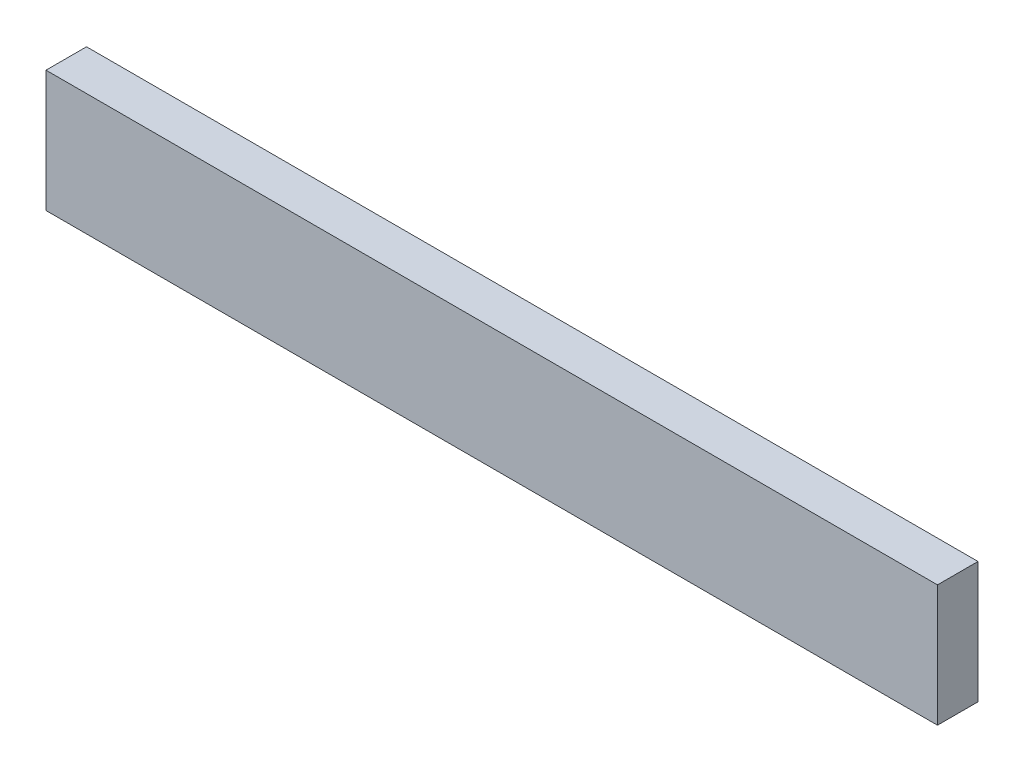
ISO-10303-21;
HEADER;
FILE_DESCRIPTION(('STEP AP214'),'2;1');
FILE_NAME('part.step','',(''),(''),'','','');
FILE_SCHEMA(('AUTOMOTIVE_DESIGN { 1 0 10303 214 1 1 1 1 }'));
ENDSEC;
DATA;
#1=APPLICATION_CONTEXT('core data for automotive mechanical design processes');
#2=APPLICATION_PROTOCOL_DEFINITION('international standard','automotive_design',2000,#1);
#3=PRODUCT_CONTEXT('',#1,'mechanical');
#4=PRODUCT('Part','Part','',(#3));
#5=PRODUCT_RELATED_PRODUCT_CATEGORY('part','',(#4));
#6=PRODUCT_DEFINITION_FORMATION('','',#4);
#7=PRODUCT_DEFINITION_CONTEXT('part definition',#1,'design');
#8=PRODUCT_DEFINITION('design','',#6,#7);
#9=PRODUCT_DEFINITION_SHAPE('','',#8);
#10=(LENGTH_UNIT() NAMED_UNIT(*) SI_UNIT(.MILLI.,.METRE.));
#11=(NAMED_UNIT(*) PLANE_ANGLE_UNIT() SI_UNIT($,.RADIAN.));
#12=(NAMED_UNIT(*) SI_UNIT($,.STERADIAN.) SOLID_ANGLE_UNIT());
#13=UNCERTAINTY_MEASURE_WITH_UNIT(LENGTH_MEASURE(1.E-05),#10,'distance_accuracy_value','');
#14=(GEOMETRIC_REPRESENTATION_CONTEXT(3) GLOBAL_UNCERTAINTY_ASSIGNED_CONTEXT((#13)) GLOBAL_UNIT_ASSIGNED_CONTEXT((#10,
#11,#12)) REPRESENTATION_CONTEXT('',''));
#15=CARTESIAN_POINT('',(0.,0.,0.));
#16=DIRECTION('',(0.,0.,1.));
#17=DIRECTION('',(1.,0.,0.));
#18=AXIS2_PLACEMENT_3D('',#15,#16,#17);
#19=CARTESIAN_POINT('',(-0.10999978,0.01500123999999,0.01));
#20=DIRECTION('',(0.,0.,-1.));
#21=DIRECTION('',(-1.,0.,0.));
#22=AXIS2_PLACEMENT_3D('',#19,#20,#21);
#23=PLANE('',#22);
#24=DIRECTION('',(1.,0.,0.));
#25=VECTOR('',#24,1.);
#26=CARTESIAN_POINT('',(-0.10999978,-0.01499870000001,0.01));
#27=LINE('',#26,#25);
#28=CARTESIAN_POINT('',(-0.10999978,-0.01499870000001,0.01));
#29=VERTEX_POINT('',#28);
#30=CARTESIAN_POINT('',(0.11000232,-0.01499870000001,0.01));
#31=VERTEX_POINT('',#30);
#32=EDGE_CURVE('E54',#29,#31,#27,.T.);
#33=ORIENTED_EDGE('',*,*,#32,.T.);
#34=DIRECTION('',(0.,1.,0.));
#35=VECTOR('',#34,1.);
#36=CARTESIAN_POINT('',(0.11000232,-0.01499870000001,0.01));
#37=LINE('',#36,#35);
#38=CARTESIAN_POINT('',(0.11000232,0.01500123999999,0.01));
#39=VERTEX_POINT('',#38);
#40=EDGE_CURVE('E56',#31,#39,#37,.T.);
#41=ORIENTED_EDGE('',*,*,#40,.T.);
#42=DIRECTION('',(1.,0.,0.));
#43=VECTOR('',#42,1.);
#44=CARTESIAN_POINT('',(0.11000232,0.01500123999999,0.01));
#45=LINE('',#44,#43);
#46=CARTESIAN_POINT('',(-0.10999978,0.01500123999999,0.01));
#47=VERTEX_POINT('',#46);
#48=EDGE_CURVE('E19',#39,#47,#45,.F.);
#49=ORIENTED_EDGE('',*,*,#48,.T.);
#50=DIRECTION('',(0.,1.,0.));
#51=VECTOR('',#50,1.);
#52=CARTESIAN_POINT('',(-0.10999978,0.01500123999999,0.01));
#53=LINE('',#52,#51);
#54=EDGE_CURVE('E79',#47,#29,#53,.F.);
#55=ORIENTED_EDGE('',*,*,#54,.T.);
#56=EDGE_LOOP('',(#33,#41,#49,#55));
#57=FACE_BOUND('',#56,.T.);
#58=ADVANCED_FACE('F16',(#57),#23,.F.);
#59=CARTESIAN_POINT('',(0.11000232,0.01500123999999,0.));
#60=DIRECTION('',(0.,-1.,0.));
#61=DIRECTION('',(0.,0.,-1.));
#62=AXIS2_PLACEMENT_3D('',#59,#60,#61);
#63=PLANE('',#62);
#64=DIRECTION('',(0.,0.,-1.));
#65=VECTOR('',#64,1.);
#66=CARTESIAN_POINT('',(-0.10999978,0.01500123999999,0.));
#67=LINE('',#66,#65);
#68=CARTESIAN_POINT('',(-0.10999978,0.01500123999999,0.));
#69=VERTEX_POINT('',#68);
#70=EDGE_CURVE('E67',#69,#47,#67,.F.);
#71=ORIENTED_EDGE('',*,*,#70,.T.);
#72=ORIENTED_EDGE('',*,*,#48,.F.);
#73=DIRECTION('',(0.,0.,1.));
#74=VECTOR('',#73,1.);
#75=CARTESIAN_POINT('',(0.11000232,0.01500123999999,0.));
#76=LINE('',#75,#74);
#77=CARTESIAN_POINT('',(0.11000232,0.01500123999999,0.));
#78=VERTEX_POINT('',#77);
#79=EDGE_CURVE('E62',#39,#78,#76,.F.);
#80=ORIENTED_EDGE('',*,*,#79,.T.);
#81=DIRECTION('',(-1.,0.,0.));
#82=VECTOR('',#81,1.);
#83=CARTESIAN_POINT('',(-0.10999978,0.01500123999999,0.));
#84=LINE('',#83,#82);
#85=EDGE_CURVE('E82',#69,#78,#84,.F.);
#86=ORIENTED_EDGE('',*,*,#85,.F.);
#87=EDGE_LOOP('',(#71,#72,#80,#86));
#88=FACE_BOUND('',#87,.T.);
#89=ADVANCED_FACE('F64',(#88),#63,.F.);
#90=CARTESIAN_POINT('',(0.11000232,-0.01499870000001,0.));
#91=DIRECTION('',(-1.,0.,0.));
#92=DIRECTION('',(0.,0.,1.));
#93=AXIS2_PLACEMENT_3D('',#90,#91,#92);
#94=PLANE('',#93);
#95=ORIENTED_EDGE('',*,*,#79,.F.);
#96=ORIENTED_EDGE('',*,*,#40,.F.);
#97=DIRECTION('',(0.,0.,1.));
#98=VECTOR('',#97,1.);
#99=CARTESIAN_POINT('',(0.11000232,-0.01499870000001,0.));
#100=LINE('',#99,#98);
#101=CARTESIAN_POINT('',(0.11000232,-0.01499870000001,0.));
#102=VERTEX_POINT('',#101);
#103=EDGE_CURVE('E74',#31,#102,#100,.F.);
#104=ORIENTED_EDGE('',*,*,#103,.T.);
#105=DIRECTION('',(0.,1.,0.));
#106=VECTOR('',#105,1.);
#107=CARTESIAN_POINT('',(0.11000232,0.01500123999999,0.));
#108=LINE('',#107,#106);
#109=EDGE_CURVE('E71',#78,#102,#108,.F.);
#110=ORIENTED_EDGE('',*,*,#109,.F.);
#111=EDGE_LOOP('',(#95,#96,#104,#110));
#112=FACE_BOUND('',#111,.T.);
#113=ADVANCED_FACE('F69',(#112),#94,.F.);
#114=CARTESIAN_POINT('',(-0.10999978,-0.01499870000001,0.));
#115=DIRECTION('',(0.,1.,0.));
#116=DIRECTION('',(0.,0.,1.));
#117=AXIS2_PLACEMENT_3D('',#114,#115,#116);
#118=PLANE('',#117);
#119=ORIENTED_EDGE('',*,*,#103,.F.);
#120=ORIENTED_EDGE('',*,*,#32,.F.);
#121=DIRECTION('',(0.,0.,-1.));
#122=VECTOR('',#121,1.);
#123=CARTESIAN_POINT('',(-0.10999978,-0.01499870000001,0.));
#124=LINE('',#123,#122);
#125=CARTESIAN_POINT('',(-0.10999978,-0.01499870000001,0.));
#126=VERTEX_POINT('',#125);
#127=EDGE_CURVE('E34',#29,#126,#124,.T.);
#128=ORIENTED_EDGE('',*,*,#127,.T.);
#129=DIRECTION('',(-1.,0.,0.));
#130=VECTOR('',#129,1.);
#131=CARTESIAN_POINT('',(-0.10999978,-0.01499870000001,0.));
#132=LINE('',#131,#130);
#133=EDGE_CURVE('E25',#102,#126,#132,.T.);
#134=ORIENTED_EDGE('',*,*,#133,.F.);
#135=EDGE_LOOP('',(#119,#120,#128,#134));
#136=FACE_BOUND('',#135,.T.);
#137=ADVANCED_FACE('F88',(#136),#118,.F.);
#138=CARTESIAN_POINT('',(-0.10999978,0.01500123999999,0.));
#139=DIRECTION('',(1.,0.,0.));
#140=DIRECTION('',(0.,0.,-1.));
#141=AXIS2_PLACEMENT_3D('',#138,#139,#140);
#142=PLANE('',#141);
#143=ORIENTED_EDGE('',*,*,#127,.F.);
#144=ORIENTED_EDGE('',*,*,#54,.F.);
#145=ORIENTED_EDGE('',*,*,#70,.F.);
#146=DIRECTION('',(0.,1.,0.));
#147=VECTOR('',#146,1.);
#148=CARTESIAN_POINT('',(-0.10999978,0.01500123999999,0.));
#149=LINE('',#148,#147);
#150=EDGE_CURVE('E11',#126,#69,#149,.T.);
#151=ORIENTED_EDGE('',*,*,#150,.F.);
#152=EDGE_LOOP('',(#143,#144,#145,#151));
#153=FACE_BOUND('',#152,.T.);
#154=ADVANCED_FACE('F90',(#153),#142,.F.);
#155=CARTESIAN_POINT('',(-0.10999978,0.01500123999999,0.));
#156=DIRECTION('',(0.,0.,-1.));
#157=DIRECTION('',(-1.,0.,0.));
#158=AXIS2_PLACEMENT_3D('',#155,#156,#157);
#159=PLANE('',#158);
#160=ORIENTED_EDGE('',*,*,#133,.T.);
#161=ORIENTED_EDGE('',*,*,#150,.T.);
#162=ORIENTED_EDGE('',*,*,#85,.T.);
#163=ORIENTED_EDGE('',*,*,#109,.T.);
#164=EDGE_LOOP('',(#160,#161,#162,#163));
#165=FACE_BOUND('',#164,.T.);
#166=ADVANCED_FACE('F87',(#165),#159,.T.);
#167=CLOSED_SHELL('',(#58,#89,#113,#137,#154,#166));
#168=MANIFOLD_SOLID_BREP('B1',#167);
#169=ADVANCED_BREP_SHAPE_REPRESENTATION('',(#18,#168),#14);
#170=SHAPE_DEFINITION_REPRESENTATION(#9,#169);
ENDSEC;
END-ISO-10303-21;
